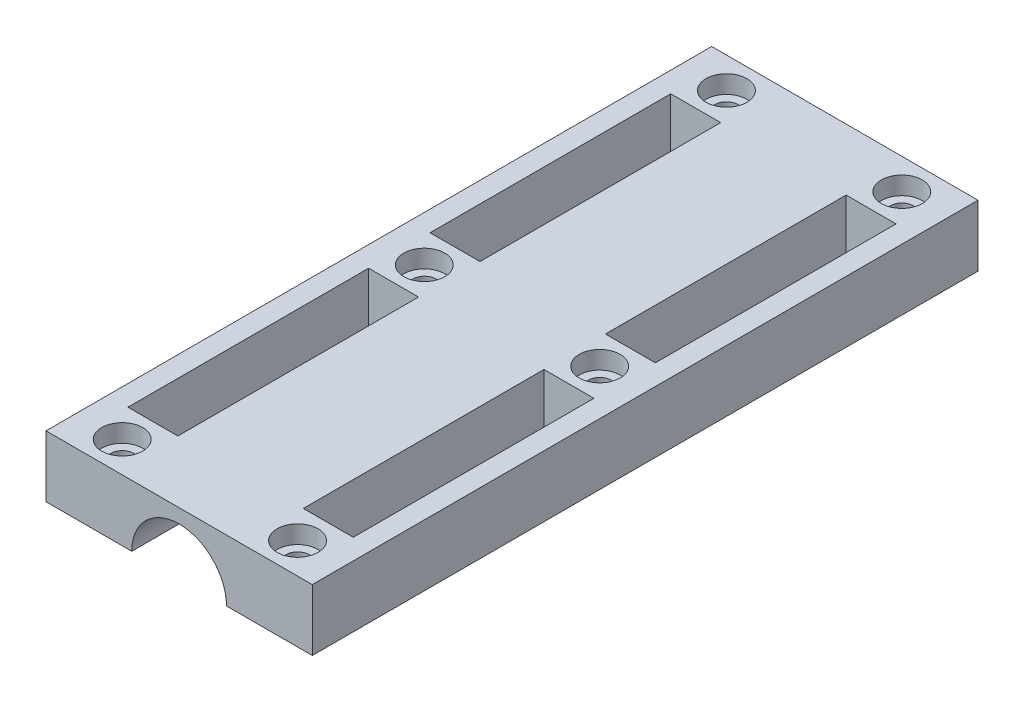
ISO-10303-21;
HEADER;
FILE_DESCRIPTION(('STEP AP214'),'2;1');
FILE_NAME('part.step','',(''),(''),'','','');
FILE_SCHEMA(('AUTOMOTIVE_DESIGN { 1 0 10303 214 1 1 1 1 }'));
ENDSEC;
DATA;
#1=APPLICATION_CONTEXT('core data for automotive mechanical design processes');
#2=APPLICATION_PROTOCOL_DEFINITION('international standard','automotive_design',2000,#1);
#3=PRODUCT_CONTEXT('',#1,'mechanical');
#4=PRODUCT('Part','Part','',(#3));
#5=PRODUCT_RELATED_PRODUCT_CATEGORY('part','',(#4));
#6=PRODUCT_DEFINITION_FORMATION('','',#4);
#7=PRODUCT_DEFINITION_CONTEXT('part definition',#1,'design');
#8=PRODUCT_DEFINITION('design','',#6,#7);
#9=PRODUCT_DEFINITION_SHAPE('','',#8);
#10=(LENGTH_UNIT() NAMED_UNIT(*) SI_UNIT(.MILLI.,.METRE.));
#11=(NAMED_UNIT(*) PLANE_ANGLE_UNIT() SI_UNIT($,.RADIAN.));
#12=(NAMED_UNIT(*) SI_UNIT($,.STERADIAN.) SOLID_ANGLE_UNIT());
#13=UNCERTAINTY_MEASURE_WITH_UNIT(LENGTH_MEASURE(1.E-05),#10,'distance_accuracy_value','');
#14=(GEOMETRIC_REPRESENTATION_CONTEXT(3) GLOBAL_UNCERTAINTY_ASSIGNED_CONTEXT((#13)) GLOBAL_UNIT_ASSIGNED_CONTEXT((#10,
#11,#12)) REPRESENTATION_CONTEXT('',''));
#15=CARTESIAN_POINT('',(0.,0.,0.));
#16=DIRECTION('',(0.,0.,1.));
#17=DIRECTION('',(1.,0.,0.));
#18=AXIS2_PLACEMENT_3D('',#15,#16,#17);
#19=CARTESIAN_POINT('',(17.125,-12.,-65.));
#20=DIRECTION('',(0.,1.,0.));
#21=DIRECTION('',(0.,0.,-1.));
#22=AXIS2_PLACEMENT_3D('',#19,#20,#21);
#23=CYLINDRICAL_SURFACE('',#22,2.25);
#24=CARTESIAN_POINT('',(17.125,-12.,-65.));
#25=DIRECTION('',(0.,1.,0.));
#26=DIRECTION('',(0.,0.,-1.));
#27=AXIS2_PLACEMENT_3D('',#24,#25,#26);
#28=CIRCLE('',#27,2.25);
#29=CARTESIAN_POINT('',(17.125,-12.,-67.25));
#30=VERTEX_POINT('',#29);
#31=EDGE_CURVE('E234',#30,#30,#28,.T.);
#32=ORIENTED_EDGE('',*,*,#31,.F.);
#33=EDGE_LOOP('',(#32));
#34=FACE_BOUND('',#33,.T.);
#35=CARTESIAN_POINT('',(17.125,-3.5,-65.));
#36=DIRECTION('',(0.,-1.,0.));
#37=DIRECTION('',(-1.,0.,0.));
#38=AXIS2_PLACEMENT_3D('',#35,#36,#37);
#39=CIRCLE('',#38,2.25);
#40=CARTESIAN_POINT('',(14.875,-3.5,-65.));
#41=VERTEX_POINT('',#40);
#42=EDGE_CURVE('E41',#41,#41,#39,.T.);
#43=ORIENTED_EDGE('',*,*,#42,.F.);
#44=EDGE_LOOP('',(#43));
#45=FACE_BOUND('',#44,.T.);
#46=ADVANCED_FACE('F37',(#34,#45),#23,.F.);
#47=CARTESIAN_POINT('',(17.125,-12.,-124.));
#48=DIRECTION('',(0.,1.,0.));
#49=DIRECTION('',(0.,0.,-1.));
#50=AXIS2_PLACEMENT_3D('',#47,#48,#49);
#51=CYLINDRICAL_SURFACE('',#50,2.25);
#52=CARTESIAN_POINT('',(17.125,-12.,-124.));
#53=DIRECTION('',(0.,1.,0.));
#54=DIRECTION('',(0.,0.,-1.));
#55=AXIS2_PLACEMENT_3D('',#52,#53,#54);
#56=CIRCLE('',#55,2.25);
#57=CARTESIAN_POINT('',(17.125,-12.,-126.25));
#58=VERTEX_POINT('',#57);
#59=EDGE_CURVE('E231',#58,#58,#56,.T.);
#60=ORIENTED_EDGE('',*,*,#59,.F.);
#61=EDGE_LOOP('',(#60));
#62=FACE_BOUND('',#61,.T.);
#63=CARTESIAN_POINT('',(17.125,-3.5,-124.));
#64=DIRECTION('',(0.,-1.,0.));
#65=DIRECTION('',(-1.,0.,0.));
#66=AXIS2_PLACEMENT_3D('',#63,#64,#65);
#67=CIRCLE('',#66,2.25);
#68=CARTESIAN_POINT('',(14.875,-3.5,-124.));
#69=VERTEX_POINT('',#68);
#70=EDGE_CURVE('E417',#69,#69,#67,.T.);
#71=ORIENTED_EDGE('',*,*,#70,.F.);
#72=EDGE_LOOP('',(#71));
#73=FACE_BOUND('',#72,.T.);
#74=ADVANCED_FACE('F488',(#62,#73),#51,.F.);
#75=CARTESIAN_POINT('',(17.125,-12.,-6.));
#76=DIRECTION('',(0.,1.,0.));
#77=DIRECTION('',(0.,0.,-1.));
#78=AXIS2_PLACEMENT_3D('',#75,#76,#77);
#79=CYLINDRICAL_SURFACE('',#78,2.25);
#80=CARTESIAN_POINT('',(17.125,-12.,-6.));
#81=DIRECTION('',(0.,1.,0.));
#82=DIRECTION('',(0.,0.,-1.));
#83=AXIS2_PLACEMENT_3D('',#80,#81,#82);
#84=CIRCLE('',#83,2.25);
#85=CARTESIAN_POINT('',(17.125,-12.,-8.25));
#86=VERTEX_POINT('',#85);
#87=EDGE_CURVE('E221',#86,#86,#84,.T.);
#88=ORIENTED_EDGE('',*,*,#87,.F.);
#89=EDGE_LOOP('',(#88));
#90=FACE_BOUND('',#89,.T.);
#91=CARTESIAN_POINT('',(17.125,-3.5,-6.));
#92=DIRECTION('',(0.,-1.,0.));
#93=DIRECTION('',(-1.,0.,0.));
#94=AXIS2_PLACEMENT_3D('',#91,#92,#93);
#95=CIRCLE('',#94,2.25);
#96=CARTESIAN_POINT('',(14.875,-3.5,-6.));
#97=VERTEX_POINT('',#96);
#98=EDGE_CURVE('E237',#97,#97,#95,.T.);
#99=ORIENTED_EDGE('',*,*,#98,.F.);
#100=EDGE_LOOP('',(#99));
#101=FACE_BOUND('',#100,.T.);
#102=ADVANCED_FACE('F483',(#90,#101),#79,.F.);
#103=CARTESIAN_POINT('',(9.25,-12.,-130.));
#104=DIRECTION('',(0.,1.,0.));
#105=DIRECTION('',(-1.,0.,0.));
#106=AXIS2_PLACEMENT_3D('',#103,#104,#105);
#107=PLANE('',#106);
#108=DIRECTION('',(-1.,0.,0.));
#109=VECTOR('',#108,1.);
#110=CARTESIAN_POINT('',(22.,-12.,-59.));
#111=LINE('',#110,#109);
#112=CARTESIAN_POINT('',(22.,-12.,-59.));
#113=VERTEX_POINT('',#112);
#114=CARTESIAN_POINT('',(12.25,-12.,-59.));
#115=VERTEX_POINT('',#114);
#116=EDGE_CURVE('E202',#113,#115,#111,.T.);
#117=ORIENTED_EDGE('',*,*,#116,.T.);
#118=DIRECTION('',(0.,0.,1.));
#119=VECTOR('',#118,1.);
#120=CARTESIAN_POINT('',(12.25,-12.,-12.));
#121=LINE('',#120,#119);
#122=CARTESIAN_POINT('',(12.25,-12.,-12.));
#123=VERTEX_POINT('',#122);
#124=EDGE_CURVE('E195',#115,#123,#121,.T.);
#125=ORIENTED_EDGE('',*,*,#124,.T.);
#126=DIRECTION('',(1.,0.,0.));
#127=VECTOR('',#126,1.);
#128=CARTESIAN_POINT('',(22.,-12.,-12.));
#129=LINE('',#128,#127);
#130=CARTESIAN_POINT('',(22.,-12.,-12.));
#131=VERTEX_POINT('',#130);
#132=EDGE_CURVE('E203',#123,#131,#129,.T.);
#133=ORIENTED_EDGE('',*,*,#132,.T.);
#134=DIRECTION('',(0.,0.,-1.));
#135=VECTOR('',#134,1.);
#136=CARTESIAN_POINT('',(22.,-12.,-12.));
#137=LINE('',#136,#135);
#138=EDGE_CURVE('E190',#131,#113,#137,.T.);
#139=ORIENTED_EDGE('',*,*,#138,.T.);
#140=EDGE_LOOP('',(#117,#125,#133,#139));
#141=FACE_BOUND('',#140,.T.);
#142=ORIENTED_EDGE('',*,*,#87,.T.);
#143=EDGE_LOOP('',(#142));
#144=FACE_BOUND('',#143,.T.);
#145=ORIENTED_EDGE('',*,*,#59,.T.);
#146=EDGE_LOOP('',(#145));
#147=FACE_BOUND('',#146,.T.);
#148=ORIENTED_EDGE('',*,*,#31,.T.);
#149=EDGE_LOOP('',(#148));
#150=FACE_BOUND('',#149,.T.);
#151=DIRECTION('',(1.,0.,0.));
#152=VECTOR('',#151,1.);
#153=CARTESIAN_POINT('',(9.25,-12.,0.));
#154=LINE('',#153,#152);
#155=CARTESIAN_POINT('',(9.25,-12.,0.));
#156=VERTEX_POINT('',#155);
#157=CARTESIAN_POINT('',(26.,-12.,0.));
#158=VERTEX_POINT('',#157);
#159=EDGE_CURVE('E389',#156,#158,#154,.T.);
#160=ORIENTED_EDGE('',*,*,#159,.F.);
#161=DIRECTION('',(0.,0.,1.));
#162=VECTOR('',#161,1.);
#163=CARTESIAN_POINT('',(9.25,-12.,-130.));
#164=LINE('',#163,#162);
#165=CARTESIAN_POINT('',(9.25,-12.,-130.));
#166=VERTEX_POINT('',#165);
#167=EDGE_CURVE('E404',#166,#156,#164,.T.);
#168=ORIENTED_EDGE('',*,*,#167,.F.);
#169=DIRECTION('',(1.,0.,0.));
#170=VECTOR('',#169,1.);
#171=CARTESIAN_POINT('',(9.25,-12.,-130.));
#172=LINE('',#171,#170);
#173=CARTESIAN_POINT('',(26.,-12.,-130.));
#174=VERTEX_POINT('',#173);
#175=EDGE_CURVE('E373',#166,#174,#172,.T.);
#176=ORIENTED_EDGE('',*,*,#175,.T.);
#177=DIRECTION('',(0.,0.,1.));
#178=VECTOR('',#177,1.);
#179=CARTESIAN_POINT('',(26.,-12.,-130.));
#180=LINE('',#179,#178);
#181=EDGE_CURVE('E401',#174,#158,#180,.T.);
#182=ORIENTED_EDGE('',*,*,#181,.T.);
#183=EDGE_LOOP('',(#160,#168,#176,#182));
#184=FACE_BOUND('',#183,.T.);
#185=DIRECTION('',(0.,0.,-1.));
#186=VECTOR('',#185,1.);
#187=CARTESIAN_POINT('',(22.,-12.,-71.));
#188=LINE('',#187,#186);
#189=CARTESIAN_POINT('',(22.,-12.,-71.));
#190=VERTEX_POINT('',#189);
#191=CARTESIAN_POINT('',(22.,-12.,-118.));
#192=VERTEX_POINT('',#191);
#193=EDGE_CURVE('E238',#190,#192,#188,.T.);
#194=ORIENTED_EDGE('',*,*,#193,.T.);
#195=DIRECTION('',(-1.,0.,0.));
#196=VECTOR('',#195,1.);
#197=CARTESIAN_POINT('',(22.,-12.,-118.));
#198=LINE('',#197,#196);
#199=CARTESIAN_POINT('',(12.25,-12.,-118.));
#200=VERTEX_POINT('',#199);
#201=EDGE_CURVE('E248',#192,#200,#198,.T.);
#202=ORIENTED_EDGE('',*,*,#201,.T.);
#203=DIRECTION('',(0.,0.,1.));
#204=VECTOR('',#203,1.);
#205=CARTESIAN_POINT('',(12.25,-12.,-71.));
#206=LINE('',#205,#204);
#207=CARTESIAN_POINT('',(12.25,-12.,-71.));
#208=VERTEX_POINT('',#207);
#209=EDGE_CURVE('E245',#200,#208,#206,.T.);
#210=ORIENTED_EDGE('',*,*,#209,.T.);
#211=DIRECTION('',(1.,0.,0.));
#212=VECTOR('',#211,1.);
#213=CARTESIAN_POINT('',(22.,-12.,-71.));
#214=LINE('',#213,#212);
#215=EDGE_CURVE('E241',#208,#190,#214,.T.);
#216=ORIENTED_EDGE('',*,*,#215,.T.);
#217=EDGE_LOOP('',(#194,#202,#210,#216));
#218=FACE_BOUND('',#217,.T.);
#219=ADVANCED_FACE('F199',(#141,#144,#147,#150,#184,#218),#107,.F.);
#220=CARTESIAN_POINT('',(-26.,0.,-130.));
#221=DIRECTION('',(0.,-1.,0.));
#222=DIRECTION('',(1.,0.,0.));
#223=AXIS2_PLACEMENT_3D('',#220,#221,#222);
#224=PLANE('',#223);
#225=CARTESIAN_POINT('',(17.125,0.,-65.));
#226=DIRECTION('',(0.,1.,0.));
#227=DIRECTION('',(1.,0.,0.));
#228=AXIS2_PLACEMENT_3D('',#225,#226,#227);
#229=CIRCLE('',#228,4.);
#230=CARTESIAN_POINT('',(21.125,0.,-65.));
#231=VERTEX_POINT('',#230);
#232=EDGE_CURVE('E424',#231,#231,#229,.T.);
#233=ORIENTED_EDGE('',*,*,#232,.F.);
#234=EDGE_LOOP('',(#233));
#235=FACE_BOUND('',#234,.T.);
#236=CARTESIAN_POINT('',(17.125,0.,-124.));
#237=DIRECTION('',(0.,1.,0.));
#238=DIRECTION('',(1.,0.,0.));
#239=AXIS2_PLACEMENT_3D('',#236,#237,#238);
#240=CIRCLE('',#239,4.);
#241=CARTESIAN_POINT('',(21.125,0.,-124.));
#242=VERTEX_POINT('',#241);
#243=EDGE_CURVE('E434',#242,#242,#240,.T.);
#244=ORIENTED_EDGE('',*,*,#243,.F.);
#245=EDGE_LOOP('',(#244));
#246=FACE_BOUND('',#245,.T.);
#247=CARTESIAN_POINT('',(17.125,0.,-6.));
#248=DIRECTION('',(0.,1.,0.));
#249=DIRECTION('',(1.,0.,0.));
#250=AXIS2_PLACEMENT_3D('',#247,#248,#249);
#251=CIRCLE('',#250,4.);
#252=CARTESIAN_POINT('',(21.125,0.,-6.));
#253=VERTEX_POINT('',#252);
#254=EDGE_CURVE('E214',#253,#253,#251,.T.);
#255=ORIENTED_EDGE('',*,*,#254,.F.);
#256=EDGE_LOOP('',(#255));
#257=FACE_BOUND('',#256,.T.);
#258=DIRECTION('',(-1.,0.,0.));
#259=VECTOR('',#258,1.);
#260=CARTESIAN_POINT('',(22.,0.,-59.));
#261=LINE('',#260,#259);
#262=CARTESIAN_POINT('',(22.,0.,-59.));
#263=VERTEX_POINT('',#262);
#264=CARTESIAN_POINT('',(12.25,0.,-59.));
#265=VERTEX_POINT('',#264);
#266=EDGE_CURVE('E219',#263,#265,#261,.T.);
#267=ORIENTED_EDGE('',*,*,#266,.F.);
#268=DIRECTION('',(0.,0.,-1.));
#269=VECTOR('',#268,1.);
#270=CARTESIAN_POINT('',(22.,0.,-12.));
#271=LINE('',#270,#269);
#272=CARTESIAN_POINT('',(22.,0.,-12.));
#273=VERTEX_POINT('',#272);
#274=EDGE_CURVE('E193',#273,#263,#271,.T.);
#275=ORIENTED_EDGE('',*,*,#274,.F.);
#276=DIRECTION('',(1.,0.,0.));
#277=VECTOR('',#276,1.);
#278=CARTESIAN_POINT('',(22.,0.,-12.));
#279=LINE('',#278,#277);
#280=CARTESIAN_POINT('',(12.25,0.,-12.));
#281=VERTEX_POINT('',#280);
#282=EDGE_CURVE('E211',#281,#273,#279,.T.);
#283=ORIENTED_EDGE('',*,*,#282,.F.);
#284=DIRECTION('',(0.,0.,1.));
#285=VECTOR('',#284,1.);
#286=CARTESIAN_POINT('',(12.25,0.,-12.));
#287=LINE('',#286,#285);
#288=EDGE_CURVE('E208',#265,#281,#287,.T.);
#289=ORIENTED_EDGE('',*,*,#288,.F.);
#290=EDGE_LOOP('',(#267,#275,#283,#289));
#291=FACE_BOUND('',#290,.T.);
#292=DIRECTION('',(-1.,0.,0.));
#293=VECTOR('',#292,1.);
#294=CARTESIAN_POINT('',(-26.,0.,0.));
#295=LINE('',#294,#293);
#296=CARTESIAN_POINT('',(26.,0.,0.));
#297=VERTEX_POINT('',#296);
#298=CARTESIAN_POINT('',(-26.,0.,0.));
#299=VERTEX_POINT('',#298);
#300=EDGE_CURVE('E368',#297,#299,#295,.T.);
#301=ORIENTED_EDGE('',*,*,#300,.F.);
#302=DIRECTION('',(0.,0.,1.));
#303=VECTOR('',#302,1.);
#304=CARTESIAN_POINT('',(26.,0.,-130.));
#305=LINE('',#304,#303);
#306=CARTESIAN_POINT('',(26.,0.,-130.));
#307=VERTEX_POINT('',#306);
#308=EDGE_CURVE('E398',#307,#297,#305,.T.);
#309=ORIENTED_EDGE('',*,*,#308,.F.);
#310=DIRECTION('',(-1.,0.,0.));
#311=VECTOR('',#310,1.);
#312=CARTESIAN_POINT('',(-26.,0.,-130.));
#313=LINE('',#312,#311);
#314=CARTESIAN_POINT('',(-26.,0.,-130.));
#315=VERTEX_POINT('',#314);
#316=EDGE_CURVE('E378',#307,#315,#313,.T.);
#317=ORIENTED_EDGE('',*,*,#316,.T.);
#318=DIRECTION('',(0.,0.,1.));
#319=VECTOR('',#318,1.);
#320=CARTESIAN_POINT('',(-26.,0.,-130.));
#321=LINE('',#320,#319);
#322=EDGE_CURVE('E381',#315,#299,#321,.T.);
#323=ORIENTED_EDGE('',*,*,#322,.T.);
#324=EDGE_LOOP('',(#301,#309,#317,#323));
#325=FACE_BOUND('',#324,.T.);
#326=DIRECTION('',(1.,0.,0.));
#327=VECTOR('',#326,1.);
#328=CARTESIAN_POINT('',(-22.,0.,-118.));
#329=LINE('',#328,#327);
#330=CARTESIAN_POINT('',(-22.,0.,-118.));
#331=VERTEX_POINT('',#330);
#332=CARTESIAN_POINT('',(-12.25,0.,-118.));
#333=VERTEX_POINT('',#332);
#334=EDGE_CURVE('E348',#331,#333,#329,.T.);
#335=ORIENTED_EDGE('',*,*,#334,.T.);
#336=DIRECTION('',(0.,0.,1.));
#337=VECTOR('',#336,1.);
#338=CARTESIAN_POINT('',(-12.25,0.,-71.));
#339=LINE('',#338,#337);
#340=CARTESIAN_POINT('',(-12.25,0.,-71.));
#341=VERTEX_POINT('',#340);
#342=EDGE_CURVE('E351',#333,#341,#339,.T.);
#343=ORIENTED_EDGE('',*,*,#342,.T.);
#344=DIRECTION('',(-1.,0.,0.));
#345=VECTOR('',#344,1.);
#346=CARTESIAN_POINT('',(-22.,0.,-71.));
#347=LINE('',#346,#345);
#348=CARTESIAN_POINT('',(-22.,0.,-71.));
#349=VERTEX_POINT('',#348);
#350=EDGE_CURVE('E336',#341,#349,#347,.T.);
#351=ORIENTED_EDGE('',*,*,#350,.T.);
#352=DIRECTION('',(0.,0.,-1.));
#353=VECTOR('',#352,1.);
#354=CARTESIAN_POINT('',(-22.,0.,-71.));
#355=LINE('',#354,#353);
#356=EDGE_CURVE('E318',#349,#331,#355,.T.);
#357=ORIENTED_EDGE('',*,*,#356,.T.);
#358=EDGE_LOOP('',(#335,#343,#351,#357));
#359=FACE_BOUND('',#358,.T.);
#360=DIRECTION('',(0.,0.,1.));
#361=VECTOR('',#360,1.);
#362=CARTESIAN_POINT('',(-12.25,0.,-12.));
#363=LINE('',#362,#361);
#364=CARTESIAN_POINT('',(-12.25,0.,-59.));
#365=VERTEX_POINT('',#364);
#366=CARTESIAN_POINT('',(-12.25,0.,-12.));
#367=VERTEX_POINT('',#366);
#368=EDGE_CURVE('E307',#365,#367,#363,.T.);
#369=ORIENTED_EDGE('',*,*,#368,.T.);
#370=DIRECTION('',(-1.,0.,0.));
#371=VECTOR('',#370,1.);
#372=CARTESIAN_POINT('',(-22.,0.,-12.));
#373=LINE('',#372,#371);
#374=CARTESIAN_POINT('',(-22.,0.,-12.));
#375=VERTEX_POINT('',#374);
#376=EDGE_CURVE('E311',#367,#375,#373,.T.);
#377=ORIENTED_EDGE('',*,*,#376,.T.);
#378=DIRECTION('',(0.,0.,-1.));
#379=VECTOR('',#378,1.);
#380=CARTESIAN_POINT('',(-22.,0.,-12.));
#381=LINE('',#380,#379);
#382=CARTESIAN_POINT('',(-22.,0.,-59.));
#383=VERTEX_POINT('',#382);
#384=EDGE_CURVE('E294',#375,#383,#381,.T.);
#385=ORIENTED_EDGE('',*,*,#384,.T.);
#386=DIRECTION('',(1.,0.,0.));
#387=VECTOR('',#386,1.);
#388=CARTESIAN_POINT('',(-22.,0.,-59.));
#389=LINE('',#388,#387);
#390=EDGE_CURVE('E304',#383,#365,#389,.T.);
#391=ORIENTED_EDGE('',*,*,#390,.T.);
#392=EDGE_LOOP('',(#369,#377,#385,#391));
#393=FACE_BOUND('',#392,.T.);
#394=CARTESIAN_POINT('',(-17.125,0.,-6.));
#395=DIRECTION('',(0.,-1.,0.));
#396=DIRECTION('',(-1.,0.,0.));
#397=AXIS2_PLACEMENT_3D('',#394,#395,#396);
#398=CIRCLE('',#397,4.);
#399=CARTESIAN_POINT('',(-21.125,0.,-6.));
#400=VERTEX_POINT('',#399);
#401=EDGE_CURVE('E286',#400,#400,#398,.T.);
#402=ORIENTED_EDGE('',*,*,#401,.T.);
#403=EDGE_LOOP('',(#402));
#404=FACE_BOUND('',#403,.T.);
#405=CARTESIAN_POINT('',(-17.125,0.,-124.));
#406=DIRECTION('',(0.,-1.,0.));
#407=DIRECTION('',(-1.,0.,0.));
#408=AXIS2_PLACEMENT_3D('',#405,#406,#407);
#409=CIRCLE('',#408,4.);
#410=CARTESIAN_POINT('',(-21.125,0.,-124.));
#411=VERTEX_POINT('',#410);
#412=EDGE_CURVE('E264',#411,#411,#409,.T.);
#413=ORIENTED_EDGE('',*,*,#412,.T.);
#414=EDGE_LOOP('',(#413));
#415=FACE_BOUND('',#414,.T.);
#416=CARTESIAN_POINT('',(-17.125,0.,-65.));
#417=DIRECTION('',(0.,-1.,0.));
#418=DIRECTION('',(-1.,0.,0.));
#419=AXIS2_PLACEMENT_3D('',#416,#417,#418);
#420=CIRCLE('',#419,4.);
#421=CARTESIAN_POINT('',(-21.125,0.,-65.));
#422=VERTEX_POINT('',#421);
#423=EDGE_CURVE('E274',#422,#422,#420,.T.);
#424=ORIENTED_EDGE('',*,*,#423,.T.);
#425=EDGE_LOOP('',(#424));
#426=FACE_BOUND('',#425,.T.);
#427=DIRECTION('',(0.,0.,-1.));
#428=VECTOR('',#427,1.);
#429=CARTESIAN_POINT('',(22.,0.,-71.));
#430=LINE('',#429,#428);
#431=CARTESIAN_POINT('',(22.,0.,-71.));
#432=VERTEX_POINT('',#431);
#433=CARTESIAN_POINT('',(22.,0.,-118.));
#434=VERTEX_POINT('',#433);
#435=EDGE_CURVE('E225',#432,#434,#430,.T.);
#436=ORIENTED_EDGE('',*,*,#435,.F.);
#437=DIRECTION('',(1.,0.,0.));
#438=VECTOR('',#437,1.);
#439=CARTESIAN_POINT('',(22.,0.,-71.));
#440=LINE('',#439,#438);
#441=CARTESIAN_POINT('',(12.25,0.,-71.));
#442=VERTEX_POINT('',#441);
#443=EDGE_CURVE('E254',#442,#432,#440,.T.);
#444=ORIENTED_EDGE('',*,*,#443,.F.);
#445=DIRECTION('',(0.,0.,1.));
#446=VECTOR('',#445,1.);
#447=CARTESIAN_POINT('',(12.25,0.,-71.));
#448=LINE('',#447,#446);
#449=CARTESIAN_POINT('',(12.25,0.,-118.));
#450=VERTEX_POINT('',#449);
#451=EDGE_CURVE('E257',#450,#442,#448,.T.);
#452=ORIENTED_EDGE('',*,*,#451,.F.);
#453=DIRECTION('',(-1.,0.,0.));
#454=VECTOR('',#453,1.);
#455=CARTESIAN_POINT('',(22.,0.,-118.));
#456=LINE('',#455,#454);
#457=EDGE_CURVE('E242',#434,#450,#456,.T.);
#458=ORIENTED_EDGE('',*,*,#457,.F.);
#459=EDGE_LOOP('',(#436,#444,#452,#458));
#460=FACE_BOUND('',#459,.T.);
#461=ADVANCED_FACE('F444',(#235,#246,#257,#291,#325,#359,#393,#404,#415,#426,#460),#224,.F.);
#462=CARTESIAN_POINT('',(-17.125,-12.,-65.));
#463=DIRECTION('',(0.,1.,0.));
#464=DIRECTION('',(0.,0.,-1.));
#465=AXIS2_PLACEMENT_3D('',#462,#463,#464);
#466=CYLINDRICAL_SURFACE('',#465,2.25);
#467=CARTESIAN_POINT('',(-17.125,-12.,-65.));
#468=DIRECTION('',(0.,-1.,0.));
#469=DIRECTION('',(0.,0.,-1.));
#470=AXIS2_PLACEMENT_3D('',#467,#468,#469);
#471=CIRCLE('',#470,2.25);
#472=CARTESIAN_POINT('',(-17.125,-12.,-67.25));
#473=VERTEX_POINT('',#472);
#474=EDGE_CURVE('E329',#473,#473,#471,.T.);
#475=ORIENTED_EDGE('',*,*,#474,.T.);
#476=EDGE_LOOP('',(#475));
#477=FACE_BOUND('',#476,.T.);
#478=CARTESIAN_POINT('',(-17.125,-3.5,-65.));
#479=DIRECTION('',(0.,-1.,0.));
#480=DIRECTION('',(-1.,0.,0.));
#481=AXIS2_PLACEMENT_3D('',#478,#479,#480);
#482=CIRCLE('',#481,2.25);
#483=CARTESIAN_POINT('',(-19.375,-3.5,-65.));
#484=VERTEX_POINT('',#483);
#485=EDGE_CURVE('E289',#484,#484,#482,.F.);
#486=ORIENTED_EDGE('',*,*,#485,.T.);
#487=EDGE_LOOP('',(#486));
#488=FACE_BOUND('',#487,.T.);
#489=ADVANCED_FACE('F447',(#477,#488),#466,.F.);
#490=CARTESIAN_POINT('',(-17.125,-12.,-124.));
#491=DIRECTION('',(0.,1.,0.));
#492=DIRECTION('',(0.,0.,-1.));
#493=AXIS2_PLACEMENT_3D('',#490,#491,#492);
#494=CYLINDRICAL_SURFACE('',#493,2.25);
#495=CARTESIAN_POINT('',(-17.125,-12.,-124.));
#496=DIRECTION('',(0.,-1.,0.));
#497=DIRECTION('',(0.,0.,-1.));
#498=AXIS2_PLACEMENT_3D('',#495,#496,#497);
#499=CIRCLE('',#498,2.25);
#500=CARTESIAN_POINT('',(-17.125,-12.,-126.25));
#501=VERTEX_POINT('',#500);
#502=EDGE_CURVE('E326',#501,#501,#499,.T.);
#503=ORIENTED_EDGE('',*,*,#502,.T.);
#504=EDGE_LOOP('',(#503));
#505=FACE_BOUND('',#504,.T.);
#506=CARTESIAN_POINT('',(-17.125,-3.5,-124.));
#507=DIRECTION('',(0.,-1.,0.));
#508=DIRECTION('',(-1.,0.,0.));
#509=AXIS2_PLACEMENT_3D('',#506,#507,#508);
#510=CIRCLE('',#509,2.25);
#511=CARTESIAN_POINT('',(-19.375,-3.5,-124.));
#512=VERTEX_POINT('',#511);
#513=EDGE_CURVE('E273',#512,#512,#510,.F.);
#514=ORIENTED_EDGE('',*,*,#513,.T.);
#515=EDGE_LOOP('',(#514));
#516=FACE_BOUND('',#515,.T.);
#517=ADVANCED_FACE('F556',(#505,#516),#494,.F.);
#518=CARTESIAN_POINT('',(-17.125,-12.,-6.));
#519=DIRECTION('',(0.,1.,0.));
#520=DIRECTION('',(0.,0.,-1.));
#521=AXIS2_PLACEMENT_3D('',#518,#519,#520);
#522=CYLINDRICAL_SURFACE('',#521,2.25);
#523=CARTESIAN_POINT('',(-17.125,-12.,-6.));
#524=DIRECTION('',(0.,-1.,0.));
#525=DIRECTION('',(0.,0.,-1.));
#526=AXIS2_PLACEMENT_3D('',#523,#524,#525);
#527=CIRCLE('',#526,2.25);
#528=CARTESIAN_POINT('',(-17.125,-12.,-8.25));
#529=VERTEX_POINT('',#528);
#530=EDGE_CURVE('E308',#529,#529,#527,.T.);
#531=ORIENTED_EDGE('',*,*,#530,.T.);
#532=EDGE_LOOP('',(#531));
#533=FACE_BOUND('',#532,.T.);
#534=CARTESIAN_POINT('',(-17.125,-3.5,-6.));
#535=DIRECTION('',(0.,-1.,0.));
#536=DIRECTION('',(-1.,0.,0.));
#537=AXIS2_PLACEMENT_3D('',#534,#535,#536);
#538=CIRCLE('',#537,2.25);
#539=CARTESIAN_POINT('',(-19.375,-3.5,-6.));
#540=VERTEX_POINT('',#539);
#541=EDGE_CURVE('E285',#540,#540,#538,.F.);
#542=ORIENTED_EDGE('',*,*,#541,.T.);
#543=EDGE_LOOP('',(#542));
#544=FACE_BOUND('',#543,.T.);
#545=ADVANCED_FACE('F553',(#533,#544),#522,.F.);
#546=CARTESIAN_POINT('',(-26.,0.,-130.));
#547=DIRECTION('',(1.,0.,0.));
#548=DIRECTION('',(0.,0.,1.));
#549=AXIS2_PLACEMENT_3D('',#546,#547,#548);
#550=PLANE('',#549);
#551=DIRECTION('',(0.,-1.,0.));
#552=VECTOR('',#551,1.);
#553=CARTESIAN_POINT('',(-26.,0.,0.));
#554=LINE('',#553,#552);
#555=CARTESIAN_POINT('',(-26.,-12.,0.));
#556=VERTEX_POINT('',#555);
#557=EDGE_CURVE('E358',#299,#556,#554,.T.);
#558=ORIENTED_EDGE('',*,*,#557,.F.);
#559=ORIENTED_EDGE('',*,*,#322,.F.);
#560=DIRECTION('',(0.,-1.,0.));
#561=VECTOR('',#560,1.);
#562=CARTESIAN_POINT('',(-26.,0.,-130.));
#563=LINE('',#562,#561);
#564=CARTESIAN_POINT('',(-26.,-12.,-130.));
#565=VERTEX_POINT('',#564);
#566=EDGE_CURVE('E364',#315,#565,#563,.T.);
#567=ORIENTED_EDGE('',*,*,#566,.T.);
#568=DIRECTION('',(0.,0.,1.));
#569=VECTOR('',#568,1.);
#570=CARTESIAN_POINT('',(-26.,-12.,-130.));
#571=LINE('',#570,#569);
#572=EDGE_CURVE('E11',#565,#556,#571,.T.);
#573=ORIENTED_EDGE('',*,*,#572,.T.);
#574=EDGE_LOOP('',(#558,#559,#567,#573));
#575=FACE_BOUND('',#574,.T.);
#576=ADVANCED_FACE('F39',(#575),#550,.F.);
#577=CARTESIAN_POINT('',(-26.,-12.,-130.));
#578=DIRECTION('',(0.,1.,0.));
#579=DIRECTION('',(0.,0.,-1.));
#580=AXIS2_PLACEMENT_3D('',#577,#578,#579);
#581=PLANE('',#580);
#582=DIRECTION('',(0.,0.,-1.));
#583=VECTOR('',#582,1.);
#584=CARTESIAN_POINT('',(-22.,-12.,-12.));
#585=LINE('',#584,#583);
#586=CARTESIAN_POINT('',(-22.,-12.,-12.));
#587=VERTEX_POINT('',#586);
#588=CARTESIAN_POINT('',(-22.,-12.,-59.));
#589=VERTEX_POINT('',#588);
#590=EDGE_CURVE('E300',#587,#589,#585,.T.);
#591=ORIENTED_EDGE('',*,*,#590,.F.);
#592=DIRECTION('',(-1.,0.,0.));
#593=VECTOR('',#592,1.);
#594=CARTESIAN_POINT('',(-22.,-12.,-12.));
#595=LINE('',#594,#593);
#596=CARTESIAN_POINT('',(-12.25,-12.,-12.));
#597=VERTEX_POINT('',#596);
#598=EDGE_CURVE('E297',#597,#587,#595,.T.);
#599=ORIENTED_EDGE('',*,*,#598,.F.);
#600=DIRECTION('',(0.,0.,1.));
#601=VECTOR('',#600,1.);
#602=CARTESIAN_POINT('',(-12.25,-12.,-12.));
#603=LINE('',#602,#601);
#604=CARTESIAN_POINT('',(-12.25,-12.,-59.));
#605=VERTEX_POINT('',#604);
#606=EDGE_CURVE('E293',#605,#597,#603,.T.);
#607=ORIENTED_EDGE('',*,*,#606,.F.);
#608=DIRECTION('',(1.,0.,0.));
#609=VECTOR('',#608,1.);
#610=CARTESIAN_POINT('',(-22.,-12.,-59.));
#611=LINE('',#610,#609);
#612=EDGE_CURVE('E290',#589,#605,#611,.T.);
#613=ORIENTED_EDGE('',*,*,#612,.F.);
#614=EDGE_LOOP('',(#591,#599,#607,#613));
#615=FACE_BOUND('',#614,.T.);
#616=ORIENTED_EDGE('',*,*,#530,.F.);
#617=EDGE_LOOP('',(#616));
#618=FACE_BOUND('',#617,.T.);
#619=ORIENTED_EDGE('',*,*,#502,.F.);
#620=EDGE_LOOP('',(#619));
#621=FACE_BOUND('',#620,.T.);
#622=ORIENTED_EDGE('',*,*,#474,.F.);
#623=EDGE_LOOP('',(#622));
#624=FACE_BOUND('',#623,.T.);
#625=DIRECTION('',(-1.,0.,0.));
#626=VECTOR('',#625,1.);
#627=CARTESIAN_POINT('',(-22.,-12.,-71.));
#628=LINE('',#627,#626);
#629=CARTESIAN_POINT('',(-12.25,-12.,-71.));
#630=VERTEX_POINT('',#629);
#631=CARTESIAN_POINT('',(-22.,-12.,-71.));
#632=VERTEX_POINT('',#631);
#633=EDGE_CURVE('E342',#630,#632,#628,.T.);
#634=ORIENTED_EDGE('',*,*,#633,.F.);
#635=DIRECTION('',(0.,0.,1.));
#636=VECTOR('',#635,1.);
#637=CARTESIAN_POINT('',(-12.25,-12.,-71.));
#638=LINE('',#637,#636);
#639=CARTESIAN_POINT('',(-12.25,-12.,-118.));
#640=VERTEX_POINT('',#639);
#641=EDGE_CURVE('E339',#640,#630,#638,.T.);
#642=ORIENTED_EDGE('',*,*,#641,.F.);
#643=DIRECTION('',(1.,0.,0.));
#644=VECTOR('',#643,1.);
#645=CARTESIAN_POINT('',(-22.,-12.,-118.));
#646=LINE('',#645,#644);
#647=CARTESIAN_POINT('',(-22.,-12.,-118.));
#648=VERTEX_POINT('',#647);
#649=EDGE_CURVE('E335',#648,#640,#646,.T.);
#650=ORIENTED_EDGE('',*,*,#649,.F.);
#651=DIRECTION('',(0.,0.,-1.));
#652=VECTOR('',#651,1.);
#653=CARTESIAN_POINT('',(-22.,-12.,-71.));
#654=LINE('',#653,#652);
#655=EDGE_CURVE('E332',#632,#648,#654,.T.);
#656=ORIENTED_EDGE('',*,*,#655,.F.);
#657=EDGE_LOOP('',(#634,#642,#650,#656));
#658=FACE_BOUND('',#657,.T.);
#659=DIRECTION('',(1.,0.,0.));
#660=VECTOR('',#659,1.);
#661=CARTESIAN_POINT('',(-26.,-12.,0.));
#662=LINE('',#661,#660);
#663=CARTESIAN_POINT('',(-9.25,-12.,0.));
#664=VERTEX_POINT('',#663);
#665=EDGE_CURVE('E384',#556,#664,#662,.T.);
#666=ORIENTED_EDGE('',*,*,#665,.F.);
#667=ORIENTED_EDGE('',*,*,#572,.F.);
#668=DIRECTION('',(1.,0.,0.));
#669=VECTOR('',#668,1.);
#670=CARTESIAN_POINT('',(-26.,-12.,-130.));
#671=LINE('',#670,#669);
#672=CARTESIAN_POINT('',(-9.25,-12.,-130.));
#673=VERTEX_POINT('',#672);
#674=EDGE_CURVE('E367',#565,#673,#671,.T.);
#675=ORIENTED_EDGE('',*,*,#674,.T.);
#676=DIRECTION('',(0.,0.,1.));
#677=VECTOR('',#676,1.);
#678=CARTESIAN_POINT('',(-9.25,-12.,-130.));
#679=LINE('',#678,#677);
#680=EDGE_CURVE('E46',#673,#664,#679,.T.);
#681=ORIENTED_EDGE('',*,*,#680,.T.);
#682=EDGE_LOOP('',(#666,#667,#675,#681));
#683=FACE_BOUND('',#682,.T.);
#684=ADVANCED_FACE('F593',(#615,#618,#621,#624,#658,#683),#581,.F.);
#685=CARTESIAN_POINT('',(0.,-12.,-130.));
#686=DIRECTION('',(0.,0.,1.));
#687=DIRECTION('',(-1.,0.,0.));
#688=AXIS2_PLACEMENT_3D('',#685,#686,#687);
#689=CYLINDRICAL_SURFACE('',#688,9.25);
#690=CARTESIAN_POINT('',(0.,-12.,0.));
#691=DIRECTION('',(0.,0.,-1.));
#692=DIRECTION('',(1.,0.,0.));
#693=AXIS2_PLACEMENT_3D('',#690,#691,#692);
#694=CIRCLE('',#693,9.25);
#695=EDGE_CURVE('E387',#664,#156,#694,.T.);
#696=ORIENTED_EDGE('',*,*,#695,.F.);
#697=ORIENTED_EDGE('',*,*,#680,.F.);
#698=CARTESIAN_POINT('',(0.,-12.,-130.));
#699=DIRECTION('',(0.,0.,-1.));
#700=DIRECTION('',(1.,0.,0.));
#701=AXIS2_PLACEMENT_3D('',#698,#699,#700);
#702=CIRCLE('',#701,9.25);
#703=EDGE_CURVE('E371',#673,#166,#702,.T.);
#704=ORIENTED_EDGE('',*,*,#703,.T.);
#705=ORIENTED_EDGE('',*,*,#167,.T.);
#706=EDGE_LOOP('',(#696,#697,#704,#705));
#707=FACE_BOUND('',#706,.T.);
#708=ADVANCED_FACE('F588',(#707),#689,.F.);
#709=CARTESIAN_POINT('',(26.,0.,-130.));
#710=DIRECTION('',(-1.,0.,0.));
#711=DIRECTION('',(0.,-1.,0.));
#712=AXIS2_PLACEMENT_3D('',#709,#710,#711);
#713=PLANE('',#712);
#714=DIRECTION('',(0.,1.,0.));
#715=VECTOR('',#714,1.);
#716=CARTESIAN_POINT('',(26.,0.,0.));
#717=LINE('',#716,#715);
#718=EDGE_CURVE('E392',#158,#297,#717,.T.);
#719=ORIENTED_EDGE('',*,*,#718,.F.);
#720=ORIENTED_EDGE('',*,*,#181,.F.);
#721=DIRECTION('',(0.,1.,0.));
#722=VECTOR('',#721,1.);
#723=CARTESIAN_POINT('',(26.,0.,-130.));
#724=LINE('',#723,#722);
#725=EDGE_CURVE('E376',#174,#307,#724,.T.);
#726=ORIENTED_EDGE('',*,*,#725,.T.);
#727=ORIENTED_EDGE('',*,*,#308,.T.);
#728=EDGE_LOOP('',(#719,#720,#726,#727));
#729=FACE_BOUND('',#728,.T.);
#730=ADVANCED_FACE('F583',(#729),#713,.F.);
#731=CARTESIAN_POINT('',(0.,-12.,-130.));
#732=DIRECTION('',(0.,0.,-1.));
#733=DIRECTION('',(1.,0.,0.));
#734=AXIS2_PLACEMENT_3D('',#731,#732,#733);
#735=PLANE('',#734);
#736=ORIENTED_EDGE('',*,*,#566,.F.);
#737=ORIENTED_EDGE('',*,*,#316,.F.);
#738=ORIENTED_EDGE('',*,*,#725,.F.);
#739=ORIENTED_EDGE('',*,*,#175,.F.);
#740=ORIENTED_EDGE('',*,*,#703,.F.);
#741=ORIENTED_EDGE('',*,*,#674,.F.);
#742=EDGE_LOOP('',(#736,#737,#738,#739,#740,#741));
#743=FACE_BOUND('',#742,.T.);
#744=ADVANCED_FACE('F580',(#743),#735,.T.);
#745=CARTESIAN_POINT('',(0.,-12.,0.));
#746=DIRECTION('',(0.,0.,-1.));
#747=DIRECTION('',(1.,0.,0.));
#748=AXIS2_PLACEMENT_3D('',#745,#746,#747);
#749=PLANE('',#748);
#750=ORIENTED_EDGE('',*,*,#557,.T.);
#751=ORIENTED_EDGE('',*,*,#665,.T.);
#752=ORIENTED_EDGE('',*,*,#695,.T.);
#753=ORIENTED_EDGE('',*,*,#159,.T.);
#754=ORIENTED_EDGE('',*,*,#718,.T.);
#755=ORIENTED_EDGE('',*,*,#300,.T.);
#756=EDGE_LOOP('',(#750,#751,#752,#753,#754,#755));
#757=FACE_BOUND('',#756,.T.);
#758=ADVANCED_FACE('F578',(#757),#749,.F.);
#759=CARTESIAN_POINT('',(-22.,-12.,-71.));
#760=DIRECTION('',(-1.,0.,0.));
#761=DIRECTION('',(0.,0.,-1.));
#762=AXIS2_PLACEMENT_3D('',#759,#760,#761);
#763=PLANE('',#762);
#764=ORIENTED_EDGE('',*,*,#356,.F.);
#765=DIRECTION('',(0.,1.,0.));
#766=VECTOR('',#765,1.);
#767=CARTESIAN_POINT('',(-22.,-12.,-71.));
#768=LINE('',#767,#766);
#769=EDGE_CURVE('E356',#632,#349,#768,.T.);
#770=ORIENTED_EDGE('',*,*,#769,.F.);
#771=ORIENTED_EDGE('',*,*,#655,.T.);
#772=DIRECTION('',(0.,1.,0.));
#773=VECTOR('',#772,1.);
#774=CARTESIAN_POINT('',(-22.,-12.,-118.));
#775=LINE('',#774,#773);
#776=EDGE_CURVE('E345',#648,#331,#775,.T.);
#777=ORIENTED_EDGE('',*,*,#776,.T.);
#778=EDGE_LOOP('',(#764,#770,#771,#777));
#779=FACE_BOUND('',#778,.T.);
#780=ADVANCED_FACE('F568',(#779),#763,.F.);
#781=CARTESIAN_POINT('',(-22.,-12.,-71.));
#782=DIRECTION('',(0.,0.,1.));
#783=DIRECTION('',(-1.,0.,0.));
#784=AXIS2_PLACEMENT_3D('',#781,#782,#783);
#785=PLANE('',#784);
#786=ORIENTED_EDGE('',*,*,#350,.F.);
#787=DIRECTION('',(0.,1.,0.));
#788=VECTOR('',#787,1.);
#789=CARTESIAN_POINT('',(-12.25,-12.,-71.));
#790=LINE('',#789,#788);
#791=EDGE_CURVE('E359',#630,#341,#790,.T.);
#792=ORIENTED_EDGE('',*,*,#791,.F.);
#793=ORIENTED_EDGE('',*,*,#633,.T.);
#794=ORIENTED_EDGE('',*,*,#769,.T.);
#795=EDGE_LOOP('',(#786,#792,#793,#794));
#796=FACE_BOUND('',#795,.T.);
#797=ADVANCED_FACE('F564',(#796),#785,.F.);
#798=CARTESIAN_POINT('',(-12.25,-12.,-71.));
#799=DIRECTION('',(1.,0.,0.));
#800=DIRECTION('',(0.,0.,1.));
#801=AXIS2_PLACEMENT_3D('',#798,#799,#800);
#802=PLANE('',#801);
#803=ORIENTED_EDGE('',*,*,#342,.F.);
#804=DIRECTION('',(0.,1.,0.));
#805=VECTOR('',#804,1.);
#806=CARTESIAN_POINT('',(-12.25,-12.,-118.));
#807=LINE('',#806,#805);
#808=EDGE_CURVE('E361',#640,#333,#807,.T.);
#809=ORIENTED_EDGE('',*,*,#808,.F.);
#810=ORIENTED_EDGE('',*,*,#641,.T.);
#811=ORIENTED_EDGE('',*,*,#791,.T.);
#812=EDGE_LOOP('',(#803,#809,#810,#811));
#813=FACE_BOUND('',#812,.T.);
#814=ADVANCED_FACE('F567',(#813),#802,.F.);
#815=CARTESIAN_POINT('',(-22.,-12.,-118.));
#816=DIRECTION('',(0.,0.,-1.));
#817=DIRECTION('',(1.,0.,0.));
#818=AXIS2_PLACEMENT_3D('',#815,#816,#817);
#819=PLANE('',#818);
#820=ORIENTED_EDGE('',*,*,#334,.F.);
#821=ORIENTED_EDGE('',*,*,#776,.F.);
#822=ORIENTED_EDGE('',*,*,#649,.T.);
#823=ORIENTED_EDGE('',*,*,#808,.T.);
#824=EDGE_LOOP('',(#820,#821,#822,#823));
#825=FACE_BOUND('',#824,.T.);
#826=ADVANCED_FACE('F551',(#825),#819,.F.);
#827=CARTESIAN_POINT('',(-22.,-12.,-59.));
#828=DIRECTION('',(0.,0.,-1.));
#829=DIRECTION('',(1.,0.,0.));
#830=AXIS2_PLACEMENT_3D('',#827,#828,#829);
#831=PLANE('',#830);
#832=ORIENTED_EDGE('',*,*,#390,.F.);
#833=DIRECTION('',(0.,1.,0.));
#834=VECTOR('',#833,1.);
#835=CARTESIAN_POINT('',(-22.,-12.,-59.));
#836=LINE('',#835,#834);
#837=EDGE_CURVE('E316',#589,#383,#836,.T.);
#838=ORIENTED_EDGE('',*,*,#837,.F.);
#839=ORIENTED_EDGE('',*,*,#612,.T.);
#840=DIRECTION('',(0.,1.,0.));
#841=VECTOR('',#840,1.);
#842=CARTESIAN_POINT('',(-12.25,-12.,-59.));
#843=LINE('',#842,#841);
#844=EDGE_CURVE('E303',#605,#365,#843,.T.);
#845=ORIENTED_EDGE('',*,*,#844,.T.);
#846=EDGE_LOOP('',(#832,#838,#839,#845));
#847=FACE_BOUND('',#846,.T.);
#848=ADVANCED_FACE('F541',(#847),#831,.F.);
#849=CARTESIAN_POINT('',(-22.,-12.,-12.));
#850=DIRECTION('',(-1.,0.,0.));
#851=DIRECTION('',(0.,0.,-1.));
#852=AXIS2_PLACEMENT_3D('',#849,#850,#851);
#853=PLANE('',#852);
#854=ORIENTED_EDGE('',*,*,#384,.F.);
#855=DIRECTION('',(0.,1.,0.));
#856=VECTOR('',#855,1.);
#857=CARTESIAN_POINT('',(-22.,-12.,-12.));
#858=LINE('',#857,#856);
#859=EDGE_CURVE('E319',#587,#375,#858,.T.);
#860=ORIENTED_EDGE('',*,*,#859,.F.);
#861=ORIENTED_EDGE('',*,*,#590,.T.);
#862=ORIENTED_EDGE('',*,*,#837,.T.);
#863=EDGE_LOOP('',(#854,#860,#861,#862));
#864=FACE_BOUND('',#863,.T.);
#865=ADVANCED_FACE('F537',(#864),#853,.F.);
#866=CARTESIAN_POINT('',(-22.,-12.,-12.));
#867=DIRECTION('',(0.,0.,1.));
#868=DIRECTION('',(-1.,0.,0.));
#869=AXIS2_PLACEMENT_3D('',#866,#867,#868);
#870=PLANE('',#869);
#871=ORIENTED_EDGE('',*,*,#376,.F.);
#872=DIRECTION('',(0.,1.,0.));
#873=VECTOR('',#872,1.);
#874=CARTESIAN_POINT('',(-12.25,-12.,-12.));
#875=LINE('',#874,#873);
#876=EDGE_CURVE('E321',#597,#367,#875,.T.);
#877=ORIENTED_EDGE('',*,*,#876,.F.);
#878=ORIENTED_EDGE('',*,*,#598,.T.);
#879=ORIENTED_EDGE('',*,*,#859,.T.);
#880=EDGE_LOOP('',(#871,#877,#878,#879));
#881=FACE_BOUND('',#880,.T.);
#882=ADVANCED_FACE('F540',(#881),#870,.F.);
#883=CARTESIAN_POINT('',(-12.25,-12.,-12.));
#884=DIRECTION('',(1.,0.,0.));
#885=DIRECTION('',(0.,0.,1.));
#886=AXIS2_PLACEMENT_3D('',#883,#884,#885);
#887=PLANE('',#886);
#888=ORIENTED_EDGE('',*,*,#368,.F.);
#889=ORIENTED_EDGE('',*,*,#844,.F.);
#890=ORIENTED_EDGE('',*,*,#606,.T.);
#891=ORIENTED_EDGE('',*,*,#876,.T.);
#892=EDGE_LOOP('',(#888,#889,#890,#891));
#893=FACE_BOUND('',#892,.T.);
#894=ADVANCED_FACE('F532',(#893),#887,.F.);
#895=CARTESIAN_POINT('',(-17.125,-3.5,-6.));
#896=DIRECTION('',(0.,1.,0.));
#897=DIRECTION('',(-1.,0.,0.));
#898=AXIS2_PLACEMENT_3D('',#895,#896,#897);
#899=PLANE('',#898);
#900=CARTESIAN_POINT('',(-17.125,-3.5,-6.));
#901=DIRECTION('',(0.,-1.,0.));
#902=DIRECTION('',(-1.,0.,0.));
#903=AXIS2_PLACEMENT_3D('',#900,#901,#902);
#904=CIRCLE('',#903,4.);
#905=CARTESIAN_POINT('',(-21.125,-3.5,-6.));
#906=VERTEX_POINT('',#905);
#907=EDGE_CURVE('E282',#906,#906,#904,.T.);
#908=ORIENTED_EDGE('',*,*,#907,.F.);
#909=EDGE_LOOP('',(#908));
#910=FACE_BOUND('',#909,.T.);
#911=ORIENTED_EDGE('',*,*,#541,.F.);
#912=EDGE_LOOP('',(#911));
#913=FACE_BOUND('',#912,.T.);
#914=ADVANCED_FACE('F529',(#910,#913),#899,.T.);
#915=CARTESIAN_POINT('',(-17.125,-3.5,-6.));
#916=DIRECTION('',(0.,1.,0.));
#917=DIRECTION('',(-1.,0.,0.));
#918=AXIS2_PLACEMENT_3D('',#915,#916,#917);
#919=CYLINDRICAL_SURFACE('',#918,4.);
#920=ORIENTED_EDGE('',*,*,#907,.T.);
#921=EDGE_LOOP('',(#920));
#922=FACE_BOUND('',#921,.T.);
#923=ORIENTED_EDGE('',*,*,#401,.F.);
#924=EDGE_LOOP('',(#923));
#925=FACE_BOUND('',#924,.T.);
#926=ADVANCED_FACE('F524',(#922,#925),#919,.F.);
#927=CARTESIAN_POINT('',(-17.125,-3.5,-124.));
#928=DIRECTION('',(0.,1.,0.));
#929=DIRECTION('',(-1.,0.,0.));
#930=AXIS2_PLACEMENT_3D('',#927,#928,#929);
#931=PLANE('',#930);
#932=CARTESIAN_POINT('',(-17.125,-3.5,-124.));
#933=DIRECTION('',(0.,-1.,0.));
#934=DIRECTION('',(-1.,0.,0.));
#935=AXIS2_PLACEMENT_3D('',#932,#933,#934);
#936=CIRCLE('',#935,4.);
#937=CARTESIAN_POINT('',(-21.125,-3.5,-124.));
#938=VERTEX_POINT('',#937);
#939=EDGE_CURVE('E277',#938,#938,#936,.T.);
#940=ORIENTED_EDGE('',*,*,#939,.F.);
#941=EDGE_LOOP('',(#940));
#942=FACE_BOUND('',#941,.T.);
#943=ORIENTED_EDGE('',*,*,#513,.F.);
#944=EDGE_LOOP('',(#943));
#945=FACE_BOUND('',#944,.T.);
#946=ADVANCED_FACE('F521',(#942,#945),#931,.T.);
#947=CARTESIAN_POINT('',(-17.125,-3.5,-124.));
#948=DIRECTION('',(0.,1.,0.));
#949=DIRECTION('',(-1.,0.,0.));
#950=AXIS2_PLACEMENT_3D('',#947,#948,#949);
#951=CYLINDRICAL_SURFACE('',#950,4.);
#952=ORIENTED_EDGE('',*,*,#939,.T.);
#953=EDGE_LOOP('',(#952));
#954=FACE_BOUND('',#953,.T.);
#955=ORIENTED_EDGE('',*,*,#412,.F.);
#956=EDGE_LOOP('',(#955));
#957=FACE_BOUND('',#956,.T.);
#958=ADVANCED_FACE('F516',(#954,#957),#951,.F.);
#959=CARTESIAN_POINT('',(-17.125,-3.5,-65.));
#960=DIRECTION('',(0.,1.,0.));
#961=DIRECTION('',(-1.,0.,0.));
#962=AXIS2_PLACEMENT_3D('',#959,#960,#961);
#963=PLANE('',#962);
#964=CARTESIAN_POINT('',(-17.125,-3.5,-65.));
#965=DIRECTION('',(0.,-1.,0.));
#966=DIRECTION('',(-1.,0.,0.));
#967=AXIS2_PLACEMENT_3D('',#964,#965,#966);
#968=CIRCLE('',#967,4.);
#969=CARTESIAN_POINT('',(-21.125,-3.5,-65.));
#970=VERTEX_POINT('',#969);
#971=EDGE_CURVE('E270',#970,#970,#968,.T.);
#972=ORIENTED_EDGE('',*,*,#971,.F.);
#973=EDGE_LOOP('',(#972));
#974=FACE_BOUND('',#973,.T.);
#975=ORIENTED_EDGE('',*,*,#485,.F.);
#976=EDGE_LOOP('',(#975));
#977=FACE_BOUND('',#976,.T.);
#978=ADVANCED_FACE('F513',(#974,#977),#963,.T.);
#979=CARTESIAN_POINT('',(-17.125,-3.5,-65.));
#980=DIRECTION('',(0.,1.,0.));
#981=DIRECTION('',(-1.,0.,0.));
#982=AXIS2_PLACEMENT_3D('',#979,#980,#981);
#983=CYLINDRICAL_SURFACE('',#982,4.);
#984=ORIENTED_EDGE('',*,*,#971,.T.);
#985=EDGE_LOOP('',(#984));
#986=FACE_BOUND('',#985,.T.);
#987=ORIENTED_EDGE('',*,*,#423,.F.);
#988=EDGE_LOOP('',(#987));
#989=FACE_BOUND('',#988,.T.);
#990=ADVANCED_FACE('F512',(#986,#989),#983,.F.);
#991=CARTESIAN_POINT('',(22.,-12.,-71.));
#992=DIRECTION('',(-1.,0.,0.));
#993=DIRECTION('',(0.,0.,-1.));
#994=AXIS2_PLACEMENT_3D('',#991,#992,#993);
#995=PLANE('',#994);
#996=ORIENTED_EDGE('',*,*,#435,.T.);
#997=DIRECTION('',(0.,1.,0.));
#998=VECTOR('',#997,1.);
#999=CARTESIAN_POINT('',(22.,-12.,-118.));
#1000=LINE('',#999,#998);
#1001=EDGE_CURVE('E262',#192,#434,#1000,.T.);
#1002=ORIENTED_EDGE('',*,*,#1001,.F.);
#1003=ORIENTED_EDGE('',*,*,#193,.F.);
#1004=DIRECTION('',(0.,1.,0.));
#1005=VECTOR('',#1004,1.);
#1006=CARTESIAN_POINT('',(22.,-12.,-71.));
#1007=LINE('',#1006,#1005);
#1008=EDGE_CURVE('E251',#190,#432,#1007,.T.);
#1009=ORIENTED_EDGE('',*,*,#1008,.T.);
#1010=EDGE_LOOP('',(#996,#1002,#1003,#1009));
#1011=FACE_BOUND('',#1010,.T.);
#1012=ADVANCED_FACE('F470',(#1011),#995,.T.);
#1013=CARTESIAN_POINT('',(22.,-12.,-118.));
#1014=DIRECTION('',(0.,0.,1.));
#1015=DIRECTION('',(-1.,0.,0.));
#1016=AXIS2_PLACEMENT_3D('',#1013,#1014,#1015);
#1017=PLANE('',#1016);
#1018=ORIENTED_EDGE('',*,*,#457,.T.);
#1019=DIRECTION('',(0.,1.,0.));
#1020=VECTOR('',#1019,1.);
#1021=CARTESIAN_POINT('',(12.25,-12.,-118.));
#1022=LINE('',#1021,#1020);
#1023=EDGE_CURVE('E265',#200,#450,#1022,.T.);
#1024=ORIENTED_EDGE('',*,*,#1023,.F.);
#1025=ORIENTED_EDGE('',*,*,#201,.F.);
#1026=ORIENTED_EDGE('',*,*,#1001,.T.);
#1027=EDGE_LOOP('',(#1018,#1024,#1025,#1026));
#1028=FACE_BOUND('',#1027,.T.);
#1029=ADVANCED_FACE('F480',(#1028),#1017,.T.);
#1030=CARTESIAN_POINT('',(12.25,-12.,-71.));
#1031=DIRECTION('',(1.,0.,0.));
#1032=DIRECTION('',(0.,0.,1.));
#1033=AXIS2_PLACEMENT_3D('',#1030,#1031,#1032);
#1034=PLANE('',#1033);
#1035=ORIENTED_EDGE('',*,*,#451,.T.);
#1036=DIRECTION('',(0.,1.,0.));
#1037=VECTOR('',#1036,1.);
#1038=CARTESIAN_POINT('',(12.25,-12.,-71.));
#1039=LINE('',#1038,#1037);
#1040=EDGE_CURVE('E267',#208,#442,#1039,.T.);
#1041=ORIENTED_EDGE('',*,*,#1040,.F.);
#1042=ORIENTED_EDGE('',*,*,#209,.F.);
#1043=ORIENTED_EDGE('',*,*,#1023,.T.);
#1044=EDGE_LOOP('',(#1035,#1041,#1042,#1043));
#1045=FACE_BOUND('',#1044,.T.);
#1046=ADVANCED_FACE('F478',(#1045),#1034,.T.);
#1047=CARTESIAN_POINT('',(22.,-12.,-71.));
#1048=DIRECTION('',(0.,0.,-1.));
#1049=DIRECTION('',(1.,0.,0.));
#1050=AXIS2_PLACEMENT_3D('',#1047,#1048,#1049);
#1051=PLANE('',#1050);
#1052=ORIENTED_EDGE('',*,*,#443,.T.);
#1053=ORIENTED_EDGE('',*,*,#1008,.F.);
#1054=ORIENTED_EDGE('',*,*,#215,.F.);
#1055=ORIENTED_EDGE('',*,*,#1040,.T.);
#1056=EDGE_LOOP('',(#1052,#1053,#1054,#1055));
#1057=FACE_BOUND('',#1056,.T.);
#1058=ADVANCED_FACE('F475',(#1057),#1051,.T.);
#1059=CARTESIAN_POINT('',(22.,-12.,-59.));
#1060=DIRECTION('',(0.,0.,1.));
#1061=DIRECTION('',(-1.,0.,0.));
#1062=AXIS2_PLACEMENT_3D('',#1059,#1060,#1061);
#1063=PLANE('',#1062);
#1064=ORIENTED_EDGE('',*,*,#266,.T.);
#1065=DIRECTION('',(0.,1.,0.));
#1066=VECTOR('',#1065,1.);
#1067=CARTESIAN_POINT('',(12.25,-12.,-59.));
#1068=LINE('',#1067,#1066);
#1069=EDGE_CURVE('E206',#115,#265,#1068,.T.);
#1070=ORIENTED_EDGE('',*,*,#1069,.F.);
#1071=ORIENTED_EDGE('',*,*,#116,.F.);
#1072=DIRECTION('',(0.,1.,0.));
#1073=VECTOR('',#1072,1.);
#1074=CARTESIAN_POINT('',(22.,-12.,-59.));
#1075=LINE('',#1074,#1073);
#1076=EDGE_CURVE('E62',#113,#263,#1075,.T.);
#1077=ORIENTED_EDGE('',*,*,#1076,.T.);
#1078=EDGE_LOOP('',(#1064,#1070,#1071,#1077));
#1079=FACE_BOUND('',#1078,.T.);
#1080=ADVANCED_FACE('F205',(#1079),#1063,.T.);
#1081=CARTESIAN_POINT('',(12.25,-12.,-12.));
#1082=DIRECTION('',(1.,0.,0.));
#1083=DIRECTION('',(0.,0.,1.));
#1084=AXIS2_PLACEMENT_3D('',#1081,#1082,#1083);
#1085=PLANE('',#1084);
#1086=ORIENTED_EDGE('',*,*,#288,.T.);
#1087=DIRECTION('',(0.,1.,0.));
#1088=VECTOR('',#1087,1.);
#1089=CARTESIAN_POINT('',(12.25,-12.,-12.));
#1090=LINE('',#1089,#1088);
#1091=EDGE_CURVE('E226',#123,#281,#1090,.T.);
#1092=ORIENTED_EDGE('',*,*,#1091,.F.);
#1093=ORIENTED_EDGE('',*,*,#124,.F.);
#1094=ORIENTED_EDGE('',*,*,#1069,.T.);
#1095=EDGE_LOOP('',(#1086,#1092,#1093,#1094));
#1096=FACE_BOUND('',#1095,.T.);
#1097=ADVANCED_FACE('F810',(#1096),#1085,.T.);
#1098=CARTESIAN_POINT('',(22.,-12.,-12.));
#1099=DIRECTION('',(0.,0.,-1.));
#1100=DIRECTION('',(1.,0.,0.));
#1101=AXIS2_PLACEMENT_3D('',#1098,#1099,#1100);
#1102=PLANE('',#1101);
#1103=ORIENTED_EDGE('',*,*,#282,.T.);
#1104=DIRECTION('',(0.,1.,0.));
#1105=VECTOR('',#1104,1.);
#1106=CARTESIAN_POINT('',(22.,-12.,-12.));
#1107=LINE('',#1106,#1105);
#1108=EDGE_CURVE('E54',#131,#273,#1107,.T.);
#1109=ORIENTED_EDGE('',*,*,#1108,.F.);
#1110=ORIENTED_EDGE('',*,*,#132,.F.);
#1111=ORIENTED_EDGE('',*,*,#1091,.T.);
#1112=EDGE_LOOP('',(#1103,#1109,#1110,#1111));
#1113=FACE_BOUND('',#1112,.T.);
#1114=ADVANCED_FACE('F818',(#1113),#1102,.T.);
#1115=CARTESIAN_POINT('',(22.,-12.,-12.));
#1116=DIRECTION('',(-1.,0.,0.));
#1117=DIRECTION('',(0.,0.,-1.));
#1118=AXIS2_PLACEMENT_3D('',#1115,#1116,#1117);
#1119=PLANE('',#1118);
#1120=ORIENTED_EDGE('',*,*,#274,.T.);
#1121=ORIENTED_EDGE('',*,*,#1076,.F.);
#1122=ORIENTED_EDGE('',*,*,#138,.F.);
#1123=ORIENTED_EDGE('',*,*,#1108,.T.);
#1124=EDGE_LOOP('',(#1120,#1121,#1122,#1123));
#1125=FACE_BOUND('',#1124,.T.);
#1126=ADVANCED_FACE('F189',(#1125),#1119,.T.);
#1127=CARTESIAN_POINT('',(17.125,-3.5,-6.));
#1128=DIRECTION('',(0.,1.,0.));
#1129=DIRECTION('',(-1.,0.,0.));
#1130=AXIS2_PLACEMENT_3D('',#1127,#1128,#1129);
#1131=CYLINDRICAL_SURFACE('',#1130,4.);
#1132=CARTESIAN_POINT('',(17.125,-3.5,-6.));
#1133=DIRECTION('',(0.,1.,0.));
#1134=DIRECTION('',(1.,0.,0.));
#1135=AXIS2_PLACEMENT_3D('',#1132,#1133,#1134);
#1136=CIRCLE('',#1135,4.);
#1137=CARTESIAN_POINT('',(21.125,-3.5,-6.));
#1138=VERTEX_POINT('',#1137);
#1139=EDGE_CURVE('E416',#1138,#1138,#1136,.T.);
#1140=ORIENTED_EDGE('',*,*,#1139,.F.);
#1141=EDGE_LOOP('',(#1140));
#1142=FACE_BOUND('',#1141,.T.);
#1143=ORIENTED_EDGE('',*,*,#254,.T.);
#1144=EDGE_LOOP('',(#1143));
#1145=FACE_BOUND('',#1144,.T.);
#1146=ADVANCED_FACE('F442',(#1142,#1145),#1131,.F.);
#1147=CARTESIAN_POINT('',(17.125,-3.5,-6.));
#1148=DIRECTION('',(0.,1.,0.));
#1149=DIRECTION('',(1.,0.,0.));
#1150=AXIS2_PLACEMENT_3D('',#1147,#1148,#1149);
#1151=PLANE('',#1150);
#1152=ORIENTED_EDGE('',*,*,#98,.T.);
#1153=EDGE_LOOP('',(#1152));
#1154=FACE_BOUND('',#1153,.T.);
#1155=ORIENTED_EDGE('',*,*,#1139,.T.);
#1156=EDGE_LOOP('',(#1155));
#1157=FACE_BOUND('',#1156,.T.);
#1158=ADVANCED_FACE('F841',(#1154,#1157),#1151,.T.);
#1159=CARTESIAN_POINT('',(17.125,-3.5,-124.));
#1160=DIRECTION('',(0.,1.,0.));
#1161=DIRECTION('',(-1.,0.,0.));
#1162=AXIS2_PLACEMENT_3D('',#1159,#1160,#1161);
#1163=CYLINDRICAL_SURFACE('',#1162,4.);
#1164=CARTESIAN_POINT('',(17.125,-3.5,-124.));
#1165=DIRECTION('',(0.,1.,0.));
#1166=DIRECTION('',(1.,0.,0.));
#1167=AXIS2_PLACEMENT_3D('',#1164,#1165,#1166);
#1168=CIRCLE('',#1167,4.);
#1169=CARTESIAN_POINT('',(21.125,-3.5,-124.));
#1170=VERTEX_POINT('',#1169);
#1171=EDGE_CURVE('E429',#1170,#1170,#1168,.T.);
#1172=ORIENTED_EDGE('',*,*,#1171,.F.);
#1173=EDGE_LOOP('',(#1172));
#1174=FACE_BOUND('',#1173,.T.);
#1175=ORIENTED_EDGE('',*,*,#243,.T.);
#1176=EDGE_LOOP('',(#1175));
#1177=FACE_BOUND('',#1176,.T.);
#1178=ADVANCED_FACE('F850',(#1174,#1177),#1163,.F.);
#1179=CARTESIAN_POINT('',(17.125,-3.5,-124.));
#1180=DIRECTION('',(0.,1.,0.));
#1181=DIRECTION('',(1.,0.,0.));
#1182=AXIS2_PLACEMENT_3D('',#1179,#1180,#1181);
#1183=PLANE('',#1182);
#1184=ORIENTED_EDGE('',*,*,#70,.T.);
#1185=EDGE_LOOP('',(#1184));
#1186=FACE_BOUND('',#1185,.T.);
#1187=ORIENTED_EDGE('',*,*,#1171,.T.);
#1188=EDGE_LOOP('',(#1187));
#1189=FACE_BOUND('',#1188,.T.);
#1190=ADVANCED_FACE('F859',(#1186,#1189),#1183,.T.);
#1191=CARTESIAN_POINT('',(17.125,-3.5,-65.));
#1192=DIRECTION('',(0.,1.,0.));
#1193=DIRECTION('',(-1.,0.,0.));
#1194=AXIS2_PLACEMENT_3D('',#1191,#1192,#1193);
#1195=CYLINDRICAL_SURFACE('',#1194,4.);
#1196=CARTESIAN_POINT('',(17.125,-3.5,-65.));
#1197=DIRECTION('',(0.,1.,0.));
#1198=DIRECTION('',(1.,0.,0.));
#1199=AXIS2_PLACEMENT_3D('',#1196,#1197,#1198);
#1200=CIRCLE('',#1199,4.);
#1201=CARTESIAN_POINT('',(21.125,-3.5,-65.));
#1202=VERTEX_POINT('',#1201);
#1203=EDGE_CURVE('E419',#1202,#1202,#1200,.T.);
#1204=ORIENTED_EDGE('',*,*,#1203,.F.);
#1205=EDGE_LOOP('',(#1204));
#1206=FACE_BOUND('',#1205,.T.);
#1207=ORIENTED_EDGE('',*,*,#232,.T.);
#1208=EDGE_LOOP('',(#1207));
#1209=FACE_BOUND('',#1208,.T.);
#1210=ADVANCED_FACE('F868',(#1206,#1209),#1195,.F.);
#1211=CARTESIAN_POINT('',(17.125,-3.5,-65.));
#1212=DIRECTION('',(0.,1.,0.));
#1213=DIRECTION('',(1.,0.,0.));
#1214=AXIS2_PLACEMENT_3D('',#1211,#1212,#1213);
#1215=PLANE('',#1214);
#1216=ORIENTED_EDGE('',*,*,#42,.T.);
#1217=EDGE_LOOP('',(#1216));
#1218=FACE_BOUND('',#1217,.T.);
#1219=ORIENTED_EDGE('',*,*,#1203,.T.);
#1220=EDGE_LOOP('',(#1219));
#1221=FACE_BOUND('',#1220,.T.);
#1222=ADVANCED_FACE('F876',(#1218,#1221),#1215,.T.);
#1223=CLOSED_SHELL('',(#46,#74,#102,#219,#461,#489,#517,#545,#576,#684,#708,#730,#744,#758,#780,
#797,#814,#826,#848,#865,#882,#894,#914,#926,#946,#958,#978,#990,#1012,#1029,#1046,#1058,#1080,
#1097,#1114,#1126,#1146,#1158,#1178,#1190,#1210,#1222));
#1224=MANIFOLD_SOLID_BREP('B2',#1223);
#1225=ADVANCED_BREP_SHAPE_REPRESENTATION('',(#18,#1224),#14);
#1226=SHAPE_DEFINITION_REPRESENTATION(#9,#1225);
ENDSEC;
END-ISO-10303-21;
